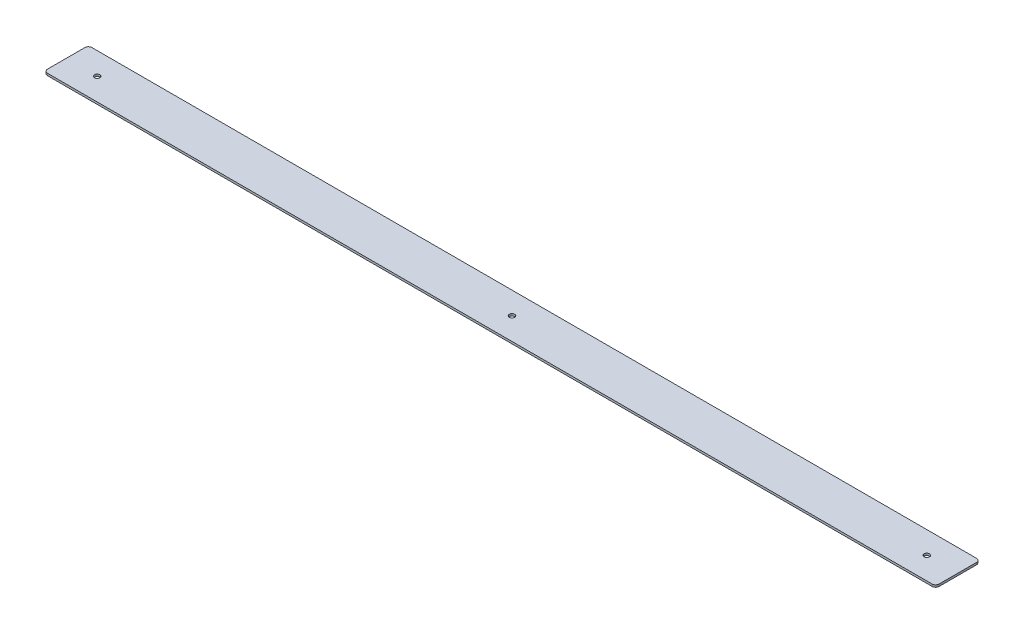
ISO-10303-21;
HEADER;
FILE_DESCRIPTION(('STEP AP214'),'2;1');
FILE_NAME('part.step','',(''),(''),'','','');
FILE_SCHEMA(('AUTOMOTIVE_DESIGN { 1 0 10303 214 1 1 1 1 }'));
ENDSEC;
DATA;
#1=APPLICATION_CONTEXT('core data for automotive mechanical design processes');
#2=APPLICATION_PROTOCOL_DEFINITION('international standard','automotive_design',2000,#1);
#3=PRODUCT_CONTEXT('',#1,'mechanical');
#4=PRODUCT('Part','Part','',(#3));
#5=PRODUCT_RELATED_PRODUCT_CATEGORY('part','',(#4));
#6=PRODUCT_DEFINITION_FORMATION('','',#4);
#7=PRODUCT_DEFINITION_CONTEXT('part definition',#1,'design');
#8=PRODUCT_DEFINITION('design','',#6,#7);
#9=PRODUCT_DEFINITION_SHAPE('','',#8);
#10=(LENGTH_UNIT() NAMED_UNIT(*) SI_UNIT(.MILLI.,.METRE.));
#11=(NAMED_UNIT(*) PLANE_ANGLE_UNIT() SI_UNIT($,.RADIAN.));
#12=(NAMED_UNIT(*) SI_UNIT($,.STERADIAN.) SOLID_ANGLE_UNIT());
#13=UNCERTAINTY_MEASURE_WITH_UNIT(LENGTH_MEASURE(1.E-05),#10,'distance_accuracy_value','');
#14=(GEOMETRIC_REPRESENTATION_CONTEXT(3) GLOBAL_UNCERTAINTY_ASSIGNED_CONTEXT((#13)) GLOBAL_UNIT_ASSIGNED_CONTEXT((#10,
#11,#12)) REPRESENTATION_CONTEXT('',''));
#15=CARTESIAN_POINT('',(0.,0.,0.));
#16=DIRECTION('',(0.,0.,1.));
#17=DIRECTION('',(1.,0.,0.));
#18=AXIS2_PLACEMENT_3D('',#15,#16,#17);
#19=CARTESIAN_POINT('',(318.283166709,1.524,15.875));
#20=DIRECTION('',(-1.,0.,0.));
#21=DIRECTION('',(0.,0.,1.));
#22=AXIS2_PLACEMENT_3D('',#19,#20,#21);
#23=PLANE('',#22);
#24=DIRECTION('',(0.,0.,-1.));
#25=VECTOR('',#24,1.);
#26=CARTESIAN_POINT('',(318.283166709,1.524,15.875));
#27=LINE('',#26,#25);
#28=CARTESIAN_POINT('',(318.283166709,1.524,13.335));
#29=VERTEX_POINT('',#28);
#30=CARTESIAN_POINT('',(318.283166709,1.524,-13.335));
#31=VERTEX_POINT('',#30);
#32=EDGE_CURVE('E116',#29,#31,#27,.T.);
#33=ORIENTED_EDGE('',*,*,#32,.F.);
#34=DIRECTION('',(0.,-1.,0.));
#35=VECTOR('',#34,1.);
#36=CARTESIAN_POINT('',(318.283166709,1.524,13.335));
#37=LINE('',#36,#35);
#38=CARTESIAN_POINT('',(318.283166709,0.,13.335));
#39=VERTEX_POINT('',#38);
#40=EDGE_CURVE('E101',#29,#39,#37,.T.);
#41=ORIENTED_EDGE('',*,*,#40,.T.);
#42=DIRECTION('',(0.,0.,-1.));
#43=VECTOR('',#42,1.);
#44=CARTESIAN_POINT('',(318.283166709,0.,15.875));
#45=LINE('',#44,#43);
#46=CARTESIAN_POINT('',(318.283166709,0.,-13.335));
#47=VERTEX_POINT('',#46);
#48=EDGE_CURVE('E113',#39,#47,#45,.T.);
#49=ORIENTED_EDGE('',*,*,#48,.T.);
#50=DIRECTION('',(0.,-1.,0.));
#51=VECTOR('',#50,1.);
#52=CARTESIAN_POINT('',(318.283166709,1.524,-13.335));
#53=LINE('',#52,#51);
#54=EDGE_CURVE('E118',#47,#31,#53,.F.);
#55=ORIENTED_EDGE('',*,*,#54,.T.);
#56=EDGE_LOOP('',(#33,#41,#49,#55));
#57=FACE_BOUND('',#56,.T.);
#58=ADVANCED_FACE('F32',(#57),#23,.F.);
#59=CARTESIAN_POINT('',(-318.283166709,1.524,-15.875));
#60=DIRECTION('',(0.,0.,1.));
#61=DIRECTION('',(1.,0.,0.));
#62=AXIS2_PLACEMENT_3D('',#59,#60,#61);
#63=PLANE('',#62);
#64=DIRECTION('',(-1.,0.,0.));
#65=VECTOR('',#64,1.);
#66=CARTESIAN_POINT('',(-318.283166709,1.524,-15.875));
#67=LINE('',#66,#65);
#68=CARTESIAN_POINT('',(315.743166709,1.524,-15.875));
#69=VERTEX_POINT('',#68);
#70=CARTESIAN_POINT('',(-315.743166709,1.524,-15.875));
#71=VERTEX_POINT('',#70);
#72=EDGE_CURVE('E171',#69,#71,#67,.T.);
#73=ORIENTED_EDGE('',*,*,#72,.F.);
#74=DIRECTION('',(0.,-1.,0.));
#75=VECTOR('',#74,1.);
#76=CARTESIAN_POINT('',(315.743166709,1.524,-15.875));
#77=LINE('',#76,#75);
#78=CARTESIAN_POINT('',(315.743166709,0.,-15.875));
#79=VERTEX_POINT('',#78);
#80=EDGE_CURVE('E155',#69,#79,#77,.T.);
#81=ORIENTED_EDGE('',*,*,#80,.T.);
#82=DIRECTION('',(-1.,0.,0.));
#83=VECTOR('',#82,1.);
#84=CARTESIAN_POINT('',(-318.283166709,0.,-15.875));
#85=LINE('',#84,#83);
#86=CARTESIAN_POINT('',(-315.743166709,0.,-15.875));
#87=VERTEX_POINT('',#86);
#88=EDGE_CURVE('E122',#79,#87,#85,.T.);
#89=ORIENTED_EDGE('',*,*,#88,.T.);
#90=DIRECTION('',(0.,-1.,0.));
#91=VECTOR('',#90,1.);
#92=CARTESIAN_POINT('',(-315.743166709,1.524,-15.875));
#93=LINE('',#92,#91);
#94=EDGE_CURVE('E153',#87,#71,#93,.F.);
#95=ORIENTED_EDGE('',*,*,#94,.T.);
#96=EDGE_LOOP('',(#73,#81,#89,#95));
#97=FACE_BOUND('',#96,.T.);
#98=ADVANCED_FACE('F221',(#97),#63,.F.);
#99=CARTESIAN_POINT('',(-318.283166709,1.524,15.875));
#100=DIRECTION('',(1.,0.,0.));
#101=DIRECTION('',(0.,0.,-1.));
#102=AXIS2_PLACEMENT_3D('',#99,#100,#101);
#103=PLANE('',#102);
#104=DIRECTION('',(0.,0.,1.));
#105=VECTOR('',#104,1.);
#106=CARTESIAN_POINT('',(-318.283166709,0.,15.875));
#107=LINE('',#106,#105);
#108=CARTESIAN_POINT('',(-318.283166709,0.,-13.335));
#109=VERTEX_POINT('',#108);
#110=CARTESIAN_POINT('',(-318.283166709,0.,13.335));
#111=VERTEX_POINT('',#110);
#112=EDGE_CURVE('E126',#109,#111,#107,.T.);
#113=ORIENTED_EDGE('',*,*,#112,.T.);
#114=DIRECTION('',(0.,-1.,0.));
#115=VECTOR('',#114,1.);
#116=CARTESIAN_POINT('',(-318.283166709,1.524,13.335));
#117=LINE('',#116,#115);
#118=CARTESIAN_POINT('',(-318.283166709,1.524,13.335));
#119=VERTEX_POINT('',#118);
#120=EDGE_CURVE('E11',#111,#119,#117,.F.);
#121=ORIENTED_EDGE('',*,*,#120,.T.);
#122=DIRECTION('',(0.,0.,1.));
#123=VECTOR('',#122,1.);
#124=CARTESIAN_POINT('',(-318.283166709,1.524,15.875));
#125=LINE('',#124,#123);
#126=CARTESIAN_POINT('',(-318.283166709,1.524,-13.335));
#127=VERTEX_POINT('',#126);
#128=EDGE_CURVE('E161',#127,#119,#125,.T.);
#129=ORIENTED_EDGE('',*,*,#128,.F.);
#130=DIRECTION('',(0.,-1.,0.));
#131=VECTOR('',#130,1.);
#132=CARTESIAN_POINT('',(-318.283166709,1.524,-13.335));
#133=LINE('',#132,#131);
#134=EDGE_CURVE('E40',#127,#109,#133,.T.);
#135=ORIENTED_EDGE('',*,*,#134,.T.);
#136=EDGE_LOOP('',(#113,#121,#129,#135));
#137=FACE_BOUND('',#136,.T.);
#138=ADVANCED_FACE('F160',(#137),#103,.F.);
#139=CARTESIAN_POINT('',(-318.283166709,1.524,15.875));
#140=DIRECTION('',(0.,0.,-1.));
#141=DIRECTION('',(-1.,0.,0.));
#142=AXIS2_PLACEMENT_3D('',#139,#140,#141);
#143=PLANE('',#142);
#144=DIRECTION('',(1.,0.,0.));
#145=VECTOR('',#144,1.);
#146=CARTESIAN_POINT('',(-318.283166709,0.,15.875));
#147=LINE('',#146,#145);
#148=CARTESIAN_POINT('',(-315.743166709,0.,15.875));
#149=VERTEX_POINT('',#148);
#150=CARTESIAN_POINT('',(315.743166709,0.,15.875));
#151=VERTEX_POINT('',#150);
#152=EDGE_CURVE('E136',#149,#151,#147,.T.);
#153=ORIENTED_EDGE('',*,*,#152,.T.);
#154=DIRECTION('',(0.,-1.,0.));
#155=VECTOR('',#154,1.);
#156=CARTESIAN_POINT('',(315.743166709,1.524,15.875));
#157=LINE('',#156,#155);
#158=CARTESIAN_POINT('',(315.743166709,1.524,15.875));
#159=VERTEX_POINT('',#158);
#160=EDGE_CURVE('E102',#151,#159,#157,.F.);
#161=ORIENTED_EDGE('',*,*,#160,.T.);
#162=DIRECTION('',(1.,0.,0.));
#163=VECTOR('',#162,1.);
#164=CARTESIAN_POINT('',(-318.283166709,1.524,15.875));
#165=LINE('',#164,#163);
#166=CARTESIAN_POINT('',(-315.743166709,1.524,15.875));
#167=VERTEX_POINT('',#166);
#168=EDGE_CURVE('E132',#167,#159,#165,.T.);
#169=ORIENTED_EDGE('',*,*,#168,.F.);
#170=DIRECTION('',(0.,-1.,0.));
#171=VECTOR('',#170,1.);
#172=CARTESIAN_POINT('',(-315.743166709,1.524,15.875));
#173=LINE('',#172,#171);
#174=EDGE_CURVE('E107',#167,#149,#173,.T.);
#175=ORIENTED_EDGE('',*,*,#174,.T.);
#176=EDGE_LOOP('',(#153,#161,#169,#175));
#177=FACE_BOUND('',#176,.T.);
#178=ADVANCED_FACE('F169',(#177),#143,.F.);
#179=CARTESIAN_POINT('',(0.,1.524,0.));
#180=DIRECTION('',(0.,-1.,0.));
#181=DIRECTION('',(0.,0.,-1.));
#182=AXIS2_PLACEMENT_3D('',#179,#180,#181);
#183=PLANE('',#182);
#184=CARTESIAN_POINT('',(296.164,1.524,-1.31014899257231E-13));
#185=DIRECTION('',(0.,1.,0.));
#186=DIRECTION('',(0.,0.,1.));
#187=AXIS2_PLACEMENT_3D('',#184,#185,#186);
#188=CIRCLE('',#187,1.90499999999999);
#189=CARTESIAN_POINT('',(296.164,1.524,1.90499999999986));
#190=VERTEX_POINT('',#189);
#191=EDGE_CURVE('E184',#190,#190,#188,.T.);
#192=ORIENTED_EDGE('',*,*,#191,.F.);
#193=EDGE_LOOP('',(#192));
#194=FACE_BOUND('',#193,.T.);
#195=CARTESIAN_POINT('',(1.11022302462516E-13,1.524,0.));
#196=DIRECTION('',(0.,1.,0.));
#197=DIRECTION('',(0.,0.,1.));
#198=AXIS2_PLACEMENT_3D('',#195,#196,#197);
#199=CIRCLE('',#198,1.905);
#200=CARTESIAN_POINT('',(1.11022302462516E-13,1.524,1.905));
#201=VERTEX_POINT('',#200);
#202=EDGE_CURVE('E178',#201,#201,#199,.T.);
#203=ORIENTED_EDGE('',*,*,#202,.F.);
#204=EDGE_LOOP('',(#203));
#205=FACE_BOUND('',#204,.T.);
#206=CARTESIAN_POINT('',(-296.164,1.524,0.));
#207=DIRECTION('',(0.,1.,0.));
#208=DIRECTION('',(0.,0.,1.));
#209=AXIS2_PLACEMENT_3D('',#206,#207,#208);
#210=CIRCLE('',#209,1.90499999999999);
#211=CARTESIAN_POINT('',(-296.164,1.524,1.90499999999997));
#212=VERTEX_POINT('',#211);
#213=EDGE_CURVE('E129',#212,#212,#210,.T.);
#214=ORIENTED_EDGE('',*,*,#213,.F.);
#215=EDGE_LOOP('',(#214));
#216=FACE_BOUND('',#215,.T.);
#217=ORIENTED_EDGE('',*,*,#168,.T.);
#218=CARTESIAN_POINT('',(315.743166709,1.524,13.335));
#219=DIRECTION('',(0.,-1.,0.));
#220=DIRECTION('',(0.,0.,-1.));
#221=AXIS2_PLACEMENT_3D('',#218,#219,#220);
#222=CIRCLE('',#221,2.54);
#223=EDGE_CURVE('E151',#159,#29,#222,.F.);
#224=ORIENTED_EDGE('',*,*,#223,.T.);
#225=ORIENTED_EDGE('',*,*,#32,.T.);
#226=CARTESIAN_POINT('',(315.743166709,1.524,-13.335));
#227=DIRECTION('',(0.,-1.,0.));
#228=DIRECTION('',(0.,0.,-1.));
#229=AXIS2_PLACEMENT_3D('',#226,#227,#228);
#230=CIRCLE('',#229,2.54);
#231=EDGE_CURVE('E149',#31,#69,#230,.F.);
#232=ORIENTED_EDGE('',*,*,#231,.T.);
#233=ORIENTED_EDGE('',*,*,#72,.T.);
#234=CARTESIAN_POINT('',(-315.743166709,1.524,-13.335));
#235=DIRECTION('',(0.,-1.,0.));
#236=DIRECTION('',(0.,0.,-1.));
#237=AXIS2_PLACEMENT_3D('',#234,#235,#236);
#238=CIRCLE('',#237,2.54);
#239=EDGE_CURVE('E52',#71,#127,#238,.F.);
#240=ORIENTED_EDGE('',*,*,#239,.T.);
#241=ORIENTED_EDGE('',*,*,#128,.T.);
#242=CARTESIAN_POINT('',(-315.743166709,1.524,13.335));
#243=DIRECTION('',(0.,-1.,0.));
#244=DIRECTION('',(0.,0.,-1.));
#245=AXIS2_PLACEMENT_3D('',#242,#243,#244);
#246=CIRCLE('',#245,2.54);
#247=EDGE_CURVE('E147',#119,#167,#246,.F.);
#248=ORIENTED_EDGE('',*,*,#247,.T.);
#249=EDGE_LOOP('',(#217,#224,#225,#232,#233,#240,#241,#248));
#250=FACE_BOUND('',#249,.T.);
#251=ADVANCED_FACE('F199',(#194,#205,#216,#250),#183,.F.);
#252=CARTESIAN_POINT('',(0.,0.,0.));
#253=DIRECTION('',(0.,-1.,0.));
#254=DIRECTION('',(0.,0.,-1.));
#255=AXIS2_PLACEMENT_3D('',#252,#253,#254);
#256=PLANE('',#255);
#257=CARTESIAN_POINT('',(296.164,0.,-1.31014899257231E-13));
#258=DIRECTION('',(0.,1.,0.));
#259=DIRECTION('',(0.,0.,1.));
#260=AXIS2_PLACEMENT_3D('',#257,#258,#259);
#261=CIRCLE('',#260,1.90499999999999);
#262=CARTESIAN_POINT('',(296.164,0.,1.90499999999986));
#263=VERTEX_POINT('',#262);
#264=EDGE_CURVE('E176',#263,#263,#261,.T.);
#265=ORIENTED_EDGE('',*,*,#264,.T.);
#266=EDGE_LOOP('',(#265));
#267=FACE_BOUND('',#266,.T.);
#268=CARTESIAN_POINT('',(1.11022302462516E-13,0.,0.));
#269=DIRECTION('',(0.,1.,0.));
#270=DIRECTION('',(0.,0.,1.));
#271=AXIS2_PLACEMENT_3D('',#268,#269,#270);
#272=CIRCLE('',#271,1.905);
#273=CARTESIAN_POINT('',(1.11022302462516E-13,0.,1.905));
#274=VERTEX_POINT('',#273);
#275=EDGE_CURVE('E181',#274,#274,#272,.T.);
#276=ORIENTED_EDGE('',*,*,#275,.T.);
#277=EDGE_LOOP('',(#276));
#278=FACE_BOUND('',#277,.T.);
#279=CARTESIAN_POINT('',(-296.164,0.,0.));
#280=DIRECTION('',(0.,1.,0.));
#281=DIRECTION('',(0.,0.,1.));
#282=AXIS2_PLACEMENT_3D('',#279,#280,#281);
#283=CIRCLE('',#282,1.90499999999999);
#284=CARTESIAN_POINT('',(-296.164,0.,1.90499999999997));
#285=VERTEX_POINT('',#284);
#286=EDGE_CURVE('E123',#285,#285,#283,.T.);
#287=ORIENTED_EDGE('',*,*,#286,.T.);
#288=EDGE_LOOP('',(#287));
#289=FACE_BOUND('',#288,.T.);
#290=ORIENTED_EDGE('',*,*,#48,.F.);
#291=CARTESIAN_POINT('',(315.743166709,0.,13.335));
#292=DIRECTION('',(0.,-1.,0.));
#293=DIRECTION('',(0.,0.,-1.));
#294=AXIS2_PLACEMENT_3D('',#291,#292,#293);
#295=CIRCLE('',#294,2.54);
#296=EDGE_CURVE('E97',#39,#151,#295,.T.);
#297=ORIENTED_EDGE('',*,*,#296,.T.);
#298=ORIENTED_EDGE('',*,*,#152,.F.);
#299=CARTESIAN_POINT('',(-315.743166709,0.,13.335));
#300=DIRECTION('',(0.,-1.,0.));
#301=DIRECTION('',(0.,0.,-1.));
#302=AXIS2_PLACEMENT_3D('',#299,#300,#301);
#303=CIRCLE('',#302,2.54);
#304=EDGE_CURVE('E140',#149,#111,#303,.T.);
#305=ORIENTED_EDGE('',*,*,#304,.T.);
#306=ORIENTED_EDGE('',*,*,#112,.F.);
#307=CARTESIAN_POINT('',(-315.743166709,0.,-13.335));
#308=DIRECTION('',(0.,-1.,0.));
#309=DIRECTION('',(0.,0.,-1.));
#310=AXIS2_PLACEMENT_3D('',#307,#308,#309);
#311=CIRCLE('',#310,2.54);
#312=EDGE_CURVE('E117',#109,#87,#311,.T.);
#313=ORIENTED_EDGE('',*,*,#312,.T.);
#314=ORIENTED_EDGE('',*,*,#88,.F.);
#315=CARTESIAN_POINT('',(315.743166709,0.,-13.335));
#316=DIRECTION('',(0.,-1.,0.));
#317=DIRECTION('',(0.,0.,-1.));
#318=AXIS2_PLACEMENT_3D('',#315,#316,#317);
#319=CIRCLE('',#318,2.54);
#320=EDGE_CURVE('E108',#79,#47,#319,.T.);
#321=ORIENTED_EDGE('',*,*,#320,.T.);
#322=EDGE_LOOP('',(#290,#297,#298,#305,#306,#313,#314,#321));
#323=FACE_BOUND('',#322,.T.);
#324=ADVANCED_FACE('F120',(#267,#278,#289,#323),#256,.T.);
#325=CARTESIAN_POINT('',(-296.164,0.,0.));
#326=DIRECTION('',(0.,1.,0.));
#327=DIRECTION('',(0.,0.,1.));
#328=AXIS2_PLACEMENT_3D('',#325,#326,#327);
#329=CYLINDRICAL_SURFACE('',#328,1.90499999999999);
#330=ORIENTED_EDGE('',*,*,#286,.F.);
#331=EDGE_LOOP('',(#330));
#332=FACE_BOUND('',#331,.T.);
#333=ORIENTED_EDGE('',*,*,#213,.T.);
#334=EDGE_LOOP('',(#333));
#335=FACE_BOUND('',#334,.T.);
#336=ADVANCED_FACE('F207',(#332,#335),#329,.F.);
#337=CARTESIAN_POINT('',(1.11022302462516E-13,0.,0.));
#338=DIRECTION('',(0.,1.,0.));
#339=DIRECTION('',(0.,0.,1.));
#340=AXIS2_PLACEMENT_3D('',#337,#338,#339);
#341=CYLINDRICAL_SURFACE('',#340,1.905);
#342=ORIENTED_EDGE('',*,*,#275,.F.);
#343=EDGE_LOOP('',(#342));
#344=FACE_BOUND('',#343,.T.);
#345=ORIENTED_EDGE('',*,*,#202,.T.);
#346=EDGE_LOOP('',(#345));
#347=FACE_BOUND('',#346,.T.);
#348=ADVANCED_FACE('F195',(#344,#347),#341,.F.);
#349=CARTESIAN_POINT('',(296.164,0.,-1.31014899257231E-13));
#350=DIRECTION('',(0.,1.,0.));
#351=DIRECTION('',(0.,0.,1.));
#352=AXIS2_PLACEMENT_3D('',#349,#350,#351);
#353=CYLINDRICAL_SURFACE('',#352,1.90499999999999);
#354=ORIENTED_EDGE('',*,*,#264,.F.);
#355=EDGE_LOOP('',(#354));
#356=FACE_BOUND('',#355,.T.);
#357=ORIENTED_EDGE('',*,*,#191,.T.);
#358=EDGE_LOOP('',(#357));
#359=FACE_BOUND('',#358,.T.);
#360=ADVANCED_FACE('F192',(#356,#359),#353,.F.);
#361=CARTESIAN_POINT('',(315.743166709,1.524,13.335));
#362=DIRECTION('',(0.,-1.,0.));
#363=DIRECTION('',(0.,0.,-1.));
#364=AXIS2_PLACEMENT_3D('',#361,#362,#363);
#365=CYLINDRICAL_SURFACE('',#364,2.54);
#366=ORIENTED_EDGE('',*,*,#223,.F.);
#367=ORIENTED_EDGE('',*,*,#160,.F.);
#368=ORIENTED_EDGE('',*,*,#296,.F.);
#369=ORIENTED_EDGE('',*,*,#40,.F.);
#370=EDGE_LOOP('',(#366,#367,#368,#369));
#371=FACE_BOUND('',#370,.T.);
#372=ADVANCED_FACE('F100',(#371),#365,.T.);
#373=CARTESIAN_POINT('',(315.743166709,1.524,-13.335));
#374=DIRECTION('',(0.,-1.,0.));
#375=DIRECTION('',(0.,0.,-1.));
#376=AXIS2_PLACEMENT_3D('',#373,#374,#375);
#377=CYLINDRICAL_SURFACE('',#376,2.54);
#378=ORIENTED_EDGE('',*,*,#231,.F.);
#379=ORIENTED_EDGE('',*,*,#54,.F.);
#380=ORIENTED_EDGE('',*,*,#320,.F.);
#381=ORIENTED_EDGE('',*,*,#80,.F.);
#382=EDGE_LOOP('',(#378,#379,#380,#381));
#383=FACE_BOUND('',#382,.T.);
#384=ADVANCED_FACE('F233',(#383),#377,.T.);
#385=CARTESIAN_POINT('',(-315.743166709,1.524,13.335));
#386=DIRECTION('',(0.,-1.,0.));
#387=DIRECTION('',(0.,0.,-1.));
#388=AXIS2_PLACEMENT_3D('',#385,#386,#387);
#389=CYLINDRICAL_SURFACE('',#388,2.54);
#390=ORIENTED_EDGE('',*,*,#247,.F.);
#391=ORIENTED_EDGE('',*,*,#120,.F.);
#392=ORIENTED_EDGE('',*,*,#304,.F.);
#393=ORIENTED_EDGE('',*,*,#174,.F.);
#394=EDGE_LOOP('',(#390,#391,#392,#393));
#395=FACE_BOUND('',#394,.T.);
#396=ADVANCED_FACE('F166',(#395),#389,.T.);
#397=CARTESIAN_POINT('',(-315.743166709,1.524,-13.335));
#398=DIRECTION('',(0.,-1.,0.));
#399=DIRECTION('',(0.,0.,-1.));
#400=AXIS2_PLACEMENT_3D('',#397,#398,#399);
#401=CYLINDRICAL_SURFACE('',#400,2.54);
#402=ORIENTED_EDGE('',*,*,#239,.F.);
#403=ORIENTED_EDGE('',*,*,#94,.F.);
#404=ORIENTED_EDGE('',*,*,#312,.F.);
#405=ORIENTED_EDGE('',*,*,#134,.F.);
#406=EDGE_LOOP('',(#402,#403,#404,#405));
#407=FACE_BOUND('',#406,.T.);
#408=ADVANCED_FACE('F34',(#407),#401,.T.);
#409=CLOSED_SHELL('',(#58,#98,#138,#178,#251,#324,#336,#348,#360,#372,#384,#396,#408));
#410=MANIFOLD_SOLID_BREP('B2',#409);
#411=ADVANCED_BREP_SHAPE_REPRESENTATION('',(#18,#410),#14);
#412=SHAPE_DEFINITION_REPRESENTATION(#9,#411);
ENDSEC;
END-ISO-10303-21;
